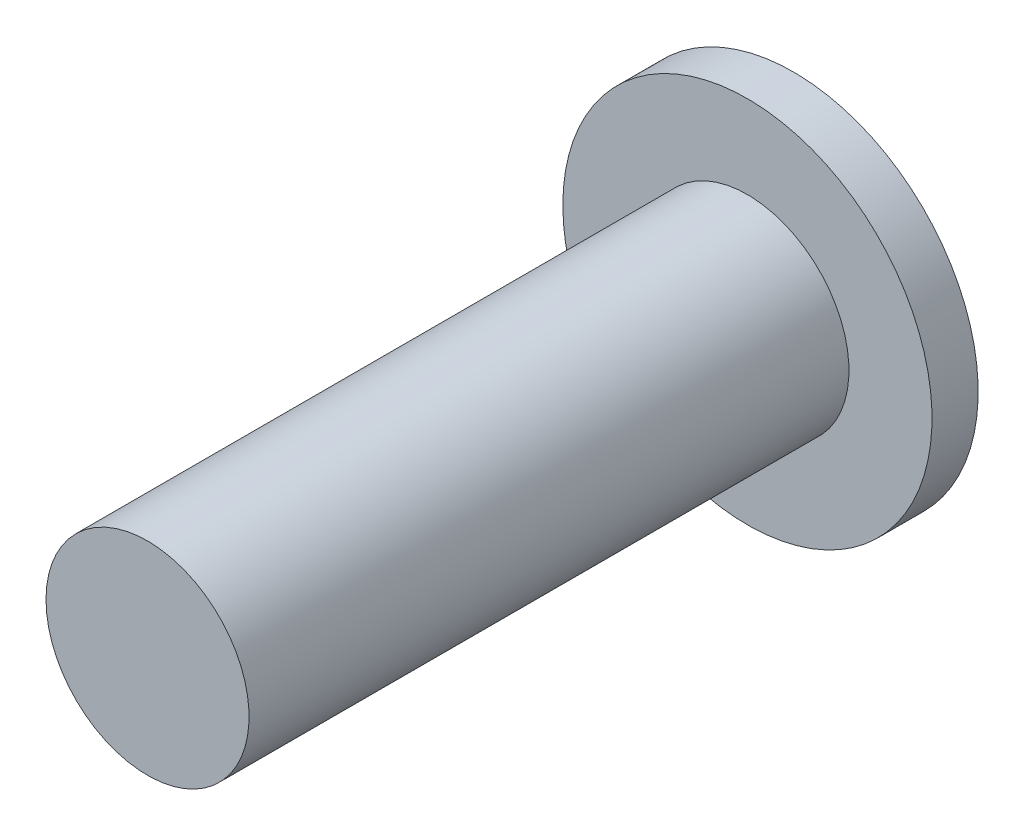
ISO-10303-21;
HEADER;
FILE_DESCRIPTION(('STEP AP214'),'2;1');
FILE_NAME('part.step','',(''),(''),'','','');
FILE_SCHEMA(('AUTOMOTIVE_DESIGN { 1 0 10303 214 1 1 1 1 }'));
ENDSEC;
DATA;
#1=APPLICATION_CONTEXT('core data for automotive mechanical design processes');
#2=APPLICATION_PROTOCOL_DEFINITION('international standard','automotive_design',2000,#1);
#3=PRODUCT_CONTEXT('',#1,'mechanical');
#4=PRODUCT('Part','Part','',(#3));
#5=PRODUCT_RELATED_PRODUCT_CATEGORY('part','',(#4));
#6=PRODUCT_DEFINITION_FORMATION('','',#4);
#7=PRODUCT_DEFINITION_CONTEXT('part definition',#1,'design');
#8=PRODUCT_DEFINITION('design','',#6,#7);
#9=PRODUCT_DEFINITION_SHAPE('','',#8);
#10=(LENGTH_UNIT() NAMED_UNIT(*) SI_UNIT(.MILLI.,.METRE.));
#11=(NAMED_UNIT(*) PLANE_ANGLE_UNIT() SI_UNIT($,.RADIAN.));
#12=(NAMED_UNIT(*) SI_UNIT($,.STERADIAN.) SOLID_ANGLE_UNIT());
#13=UNCERTAINTY_MEASURE_WITH_UNIT(LENGTH_MEASURE(1.E-05),#10,'distance_accuracy_value','');
#14=(GEOMETRIC_REPRESENTATION_CONTEXT(3) GLOBAL_UNCERTAINTY_ASSIGNED_CONTEXT((#13)) GLOBAL_UNIT_ASSIGNED_CONTEXT((#10,
#11,#12)) REPRESENTATION_CONTEXT('',''));
#15=CARTESIAN_POINT('',(0.,0.,0.));
#16=DIRECTION('',(0.,0.,1.));
#17=DIRECTION('',(1.,0.,0.));
#18=AXIS2_PLACEMENT_3D('',#15,#16,#17);
#19=CARTESIAN_POINT('',(0.,0.,0.));
#20=DIRECTION('',(0.,0.,1.));
#21=DIRECTION('',(1.,0.,0.));
#22=AXIS2_PLACEMENT_3D('',#19,#20,#21);
#23=PLANE('',#22);
#24=CARTESIAN_POINT('',(0.,0.,0.));
#25=DIRECTION('',(0.,0.,1.));
#26=DIRECTION('',(1.,0.,0.));
#27=AXIS2_PLACEMENT_3D('',#24,#25,#26);
#28=CIRCLE('',#27,2.2);
#29=CARTESIAN_POINT('',(-2.2,0.,0.));
#30=VERTEX_POINT('',#29);
#31=EDGE_CURVE('E99',#30,#30,#28,.T.);
#32=ORIENTED_EDGE('',*,*,#31,.F.);
#33=EDGE_LOOP('',(#32));
#34=FACE_BOUND('',#33,.T.);
#35=CARTESIAN_POINT('',(0.,0.,0.));
#36=DIRECTION('',(0.,0.,1.));
#37=DIRECTION('',(1.,0.,0.));
#38=AXIS2_PLACEMENT_3D('',#35,#36,#37);
#39=CIRCLE('',#38,4.);
#40=CARTESIAN_POINT('',(-4.,0.,0.));
#41=VERTEX_POINT('',#40);
#42=EDGE_CURVE('E11',#41,#41,#39,.T.);
#43=ORIENTED_EDGE('',*,*,#42,.T.);
#44=EDGE_LOOP('',(#43));
#45=FACE_BOUND('',#44,.T.);
#46=ADVANCED_FACE('F16',(#34,#45),#23,.T.);
#47=CARTESIAN_POINT('',(0.,0.,-1.));
#48=DIRECTION('',(0.,0.,1.));
#49=DIRECTION('',(1.,0.,0.));
#50=AXIS2_PLACEMENT_3D('',#47,#48,#49);
#51=PLANE('',#50);
#52=DIRECTION('',(0.,1.,0.));
#53=VECTOR('',#52,1.);
#54=CARTESIAN_POINT('',(-0.775906475947883,-0.398152632129984,-1.));
#55=LINE('',#54,#53);
#56=CARTESIAN_POINT('',(-0.775906475947883,-0.796305264259968,-1.));
#57=VERTEX_POINT('',#56);
#58=CARTESIAN_POINT('',(-0.775906475947883,0.796305264259968,-1.));
#59=VERTEX_POINT('',#58);
#60=EDGE_CURVE('E143',#57,#59,#55,.T.);
#61=ORIENTED_EDGE('',*,*,#60,.F.);
#62=DIRECTION('',(-1.,0.,0.));
#63=VECTOR('',#62,1.);
#64=CARTESIAN_POINT('',(0.387953237973941,-0.796305264259968,-1.));
#65=LINE('',#64,#63);
#66=CARTESIAN_POINT('',(0.775906475947883,-0.796305264259968,-1.));
#67=VERTEX_POINT('',#66);
#68=EDGE_CURVE('E118',#67,#57,#65,.T.);
#69=ORIENTED_EDGE('',*,*,#68,.F.);
#70=DIRECTION('',(0.,-1.,0.));
#71=VECTOR('',#70,1.);
#72=CARTESIAN_POINT('',(0.775906475947883,0.398152632129984,-1.));
#73=LINE('',#72,#71);
#74=CARTESIAN_POINT('',(0.775906475947883,0.796305264259968,-1.));
#75=VERTEX_POINT('',#74);
#76=EDGE_CURVE('E130',#75,#67,#73,.T.);
#77=ORIENTED_EDGE('',*,*,#76,.F.);
#78=DIRECTION('',(1.,0.,0.));
#79=VECTOR('',#78,1.);
#80=CARTESIAN_POINT('',(-0.387953237973941,0.796305264259968,-1.));
#81=LINE('',#80,#79);
#82=EDGE_CURVE('E73',#59,#75,#81,.T.);
#83=ORIENTED_EDGE('',*,*,#82,.F.);
#84=EDGE_LOOP('',(#61,#69,#77,#83));
#85=FACE_BOUND('',#84,.T.);
#86=CARTESIAN_POINT('',(0.,0.,-1.));
#87=DIRECTION('',(0.,0.,1.));
#88=DIRECTION('',(1.,0.,0.));
#89=AXIS2_PLACEMENT_3D('',#86,#87,#88);
#90=CIRCLE('',#89,4.);
#91=CARTESIAN_POINT('',(-4.,0.,-1.));
#92=VERTEX_POINT('',#91);
#93=EDGE_CURVE('E106',#92,#92,#90,.T.);
#94=ORIENTED_EDGE('',*,*,#93,.F.);
#95=EDGE_LOOP('',(#94));
#96=FACE_BOUND('',#95,.T.);
#97=ADVANCED_FACE('F154',(#85,#96),#51,.F.);
#98=CARTESIAN_POINT('',(0.,0.,0.));
#99=DIRECTION('',(0.,0.,1.));
#100=DIRECTION('',(1.,0.,0.));
#101=AXIS2_PLACEMENT_3D('',#98,#99,#100);
#102=CYLINDRICAL_SURFACE('',#101,4.);
#103=ORIENTED_EDGE('',*,*,#93,.T.);
#104=DIRECTION('',(0.,0.,1.));
#105=VECTOR('',#104,1.);
#106=CARTESIAN_POINT('',(-4.,0.,0.));
#107=LINE('',#106,#105);
#108=EDGE_CURVE('E27',#92,#41,#107,.T.);
#109=ORIENTED_EDGE('',*,*,#108,.T.);
#110=ORIENTED_EDGE('',*,*,#42,.F.);
#111=ORIENTED_EDGE('',*,*,#108,.F.);
#112=EDGE_LOOP('',(#103,#109,#110,#111));
#113=FACE_BOUND('',#112,.T.);
#114=ADVANCED_FACE('F151',(#113),#102,.T.);
#115=CARTESIAN_POINT('',(0.,0.,0.));
#116=DIRECTION('',(0.,0.,-1.));
#117=DIRECTION('',(1.,0.,0.));
#118=AXIS2_PLACEMENT_3D('',#115,#116,#117);
#119=CYLINDRICAL_SURFACE('',#118,2.2);
#120=CARTESIAN_POINT('',(0.,0.,13.));
#121=DIRECTION('',(0.,0.,-1.));
#122=DIRECTION('',(1.,0.,0.));
#123=AXIS2_PLACEMENT_3D('',#120,#121,#122);
#124=CIRCLE('',#123,2.2);
#125=CARTESIAN_POINT('',(-2.2,0.,13.));
#126=VERTEX_POINT('',#125);
#127=EDGE_CURVE('E97',#126,#126,#124,.T.);
#128=ORIENTED_EDGE('',*,*,#127,.T.);
#129=DIRECTION('',(0.,0.,-1.));
#130=VECTOR('',#129,1.);
#131=CARTESIAN_POINT('',(-2.2,0.,0.));
#132=LINE('',#131,#130);
#133=EDGE_CURVE('E20',#126,#30,#132,.T.);
#134=ORIENTED_EDGE('',*,*,#133,.T.);
#135=ORIENTED_EDGE('',*,*,#31,.T.);
#136=ORIENTED_EDGE('',*,*,#133,.F.);
#137=EDGE_LOOP('',(#128,#134,#135,#136));
#138=FACE_BOUND('',#137,.T.);
#139=ADVANCED_FACE('F18',(#138),#119,.T.);
#140=CARTESIAN_POINT('',(0.,0.,-0.5));
#141=DIRECTION('',(0.,0.,-1.));
#142=DIRECTION('',(0.,-1.,0.));
#143=AXIS2_PLACEMENT_3D('',#140,#141,#142);
#144=PLANE('',#143);
#145=DIRECTION('',(1.,0.,0.));
#146=VECTOR('',#145,1.);
#147=CARTESIAN_POINT('',(-0.775906475947883,0.796305264259968,-0.5));
#148=LINE('',#147,#146);
#149=CARTESIAN_POINT('',(-0.775906475947883,0.796305264259968,-0.5));
#150=VERTEX_POINT('',#149);
#151=CARTESIAN_POINT('',(0.775906475947883,0.796305264259968,-0.5));
#152=VERTEX_POINT('',#151);
#153=EDGE_CURVE('E80',#150,#152,#148,.T.);
#154=ORIENTED_EDGE('',*,*,#153,.T.);
#155=DIRECTION('',(0.,-1.,0.));
#156=VECTOR('',#155,1.);
#157=CARTESIAN_POINT('',(0.775906475947883,0.796305264259968,-0.5));
#158=LINE('',#157,#156);
#159=CARTESIAN_POINT('',(0.775906475947883,-0.796305264259968,-0.5));
#160=VERTEX_POINT('',#159);
#161=EDGE_CURVE('E127',#152,#160,#158,.T.);
#162=ORIENTED_EDGE('',*,*,#161,.T.);
#163=DIRECTION('',(-1.,0.,0.));
#164=VECTOR('',#163,1.);
#165=CARTESIAN_POINT('',(0.775906475947883,-0.796305264259968,-0.5));
#166=LINE('',#165,#164);
#167=CARTESIAN_POINT('',(-0.775906475947883,-0.796305264259968,-0.5));
#168=VERTEX_POINT('',#167);
#169=EDGE_CURVE('E86',#160,#168,#166,.T.);
#170=ORIENTED_EDGE('',*,*,#169,.T.);
#171=DIRECTION('',(0.,1.,0.));
#172=VECTOR('',#171,1.);
#173=CARTESIAN_POINT('',(-0.775906475947883,-0.796305264259968,-0.5));
#174=LINE('',#173,#172);
#175=EDGE_CURVE('E116',#168,#150,#174,.T.);
#176=ORIENTED_EDGE('',*,*,#175,.T.);
#177=EDGE_LOOP('',(#154,#162,#170,#176));
#178=FACE_BOUND('',#177,.T.);
#179=ADVANCED_FACE('F185',(#178),#144,.T.);
#180=CARTESIAN_POINT('',(-0.775906475947883,0.796305264259968,-1.));
#181=DIRECTION('',(0.,-1.,0.));
#182=DIRECTION('',(0.,0.,-1.));
#183=AXIS2_PLACEMENT_3D('',#180,#181,#182);
#184=PLANE('',#183);
#185=ORIENTED_EDGE('',*,*,#82,.T.);
#186=DIRECTION('',(0.,0.,1.));
#187=VECTOR('',#186,1.);
#188=CARTESIAN_POINT('',(0.775906475947883,0.796305264259968,-1.));
#189=LINE('',#188,#187);
#190=EDGE_CURVE('E112',#75,#152,#189,.T.);
#191=ORIENTED_EDGE('',*,*,#190,.T.);
#192=ORIENTED_EDGE('',*,*,#153,.F.);
#193=DIRECTION('',(0.,0.,1.));
#194=VECTOR('',#193,1.);
#195=CARTESIAN_POINT('',(-0.775906475947883,0.796305264259968,-1.));
#196=LINE('',#195,#194);
#197=EDGE_CURVE('E139',#59,#150,#196,.T.);
#198=ORIENTED_EDGE('',*,*,#197,.F.);
#199=EDGE_LOOP('',(#185,#191,#192,#198));
#200=FACE_BOUND('',#199,.T.);
#201=ADVANCED_FACE('F177',(#200),#184,.T.);
#202=CARTESIAN_POINT('',(0.775906475947883,0.796305264259968,-1.));
#203=DIRECTION('',(-1.,0.,0.));
#204=DIRECTION('',(0.,0.,1.));
#205=AXIS2_PLACEMENT_3D('',#202,#203,#204);
#206=PLANE('',#205);
#207=ORIENTED_EDGE('',*,*,#76,.T.);
#208=DIRECTION('',(0.,0.,1.));
#209=VECTOR('',#208,1.);
#210=CARTESIAN_POINT('',(0.775906475947883,-0.796305264259968,-1.));
#211=LINE('',#210,#209);
#212=EDGE_CURVE('E132',#67,#160,#211,.T.);
#213=ORIENTED_EDGE('',*,*,#212,.T.);
#214=ORIENTED_EDGE('',*,*,#161,.F.);
#215=ORIENTED_EDGE('',*,*,#190,.F.);
#216=EDGE_LOOP('',(#207,#213,#214,#215));
#217=FACE_BOUND('',#216,.T.);
#218=ADVANCED_FACE('F175',(#217),#206,.T.);
#219=CARTESIAN_POINT('',(0.775906475947883,-0.796305264259968,-1.));
#220=DIRECTION('',(0.,1.,0.));
#221=DIRECTION('',(1.,0.,0.));
#222=AXIS2_PLACEMENT_3D('',#219,#220,#221);
#223=PLANE('',#222);
#224=ORIENTED_EDGE('',*,*,#68,.T.);
#225=DIRECTION('',(0.,0.,1.));
#226=VECTOR('',#225,1.);
#227=CARTESIAN_POINT('',(-0.775906475947883,-0.796305264259968,-1.));
#228=LINE('',#227,#226);
#229=EDGE_CURVE('E120',#57,#168,#228,.T.);
#230=ORIENTED_EDGE('',*,*,#229,.T.);
#231=ORIENTED_EDGE('',*,*,#169,.F.);
#232=ORIENTED_EDGE('',*,*,#212,.F.);
#233=EDGE_LOOP('',(#224,#230,#231,#232));
#234=FACE_BOUND('',#233,.T.);
#235=ADVANCED_FACE('F173',(#234),#223,.T.);
#236=CARTESIAN_POINT('',(-0.775906475947883,-0.796305264259968,-1.));
#237=DIRECTION('',(1.,0.,0.));
#238=DIRECTION('',(0.,1.,0.));
#239=AXIS2_PLACEMENT_3D('',#236,#237,#238);
#240=PLANE('',#239);
#241=ORIENTED_EDGE('',*,*,#60,.T.);
#242=ORIENTED_EDGE('',*,*,#197,.T.);
#243=ORIENTED_EDGE('',*,*,#175,.F.);
#244=ORIENTED_EDGE('',*,*,#229,.F.);
#245=EDGE_LOOP('',(#241,#242,#243,#244));
#246=FACE_BOUND('',#245,.T.);
#247=ADVANCED_FACE('F170',(#246),#240,.T.);
#248=CARTESIAN_POINT('',(0.,0.,13.));
#249=DIRECTION('',(0.,0.,1.));
#250=DIRECTION('',(1.,0.,0.));
#251=AXIS2_PLACEMENT_3D('',#248,#249,#250);
#252=PLANE('',#251);
#253=ORIENTED_EDGE('',*,*,#127,.F.);
#254=EDGE_LOOP('',(#253));
#255=FACE_BOUND('',#254,.T.);
#256=ADVANCED_FACE('F167',(#255),#252,.T.);
#257=CLOSED_SHELL('',(#46,#97,#114,#139,#179,#201,#218,#235,#247,#256));
#258=MANIFOLD_SOLID_BREP('B1',#257);
#259=ADVANCED_BREP_SHAPE_REPRESENTATION('',(#18,#258),#14);
#260=SHAPE_DEFINITION_REPRESENTATION(#9,#259);
ENDSEC;
END-ISO-10303-21;
